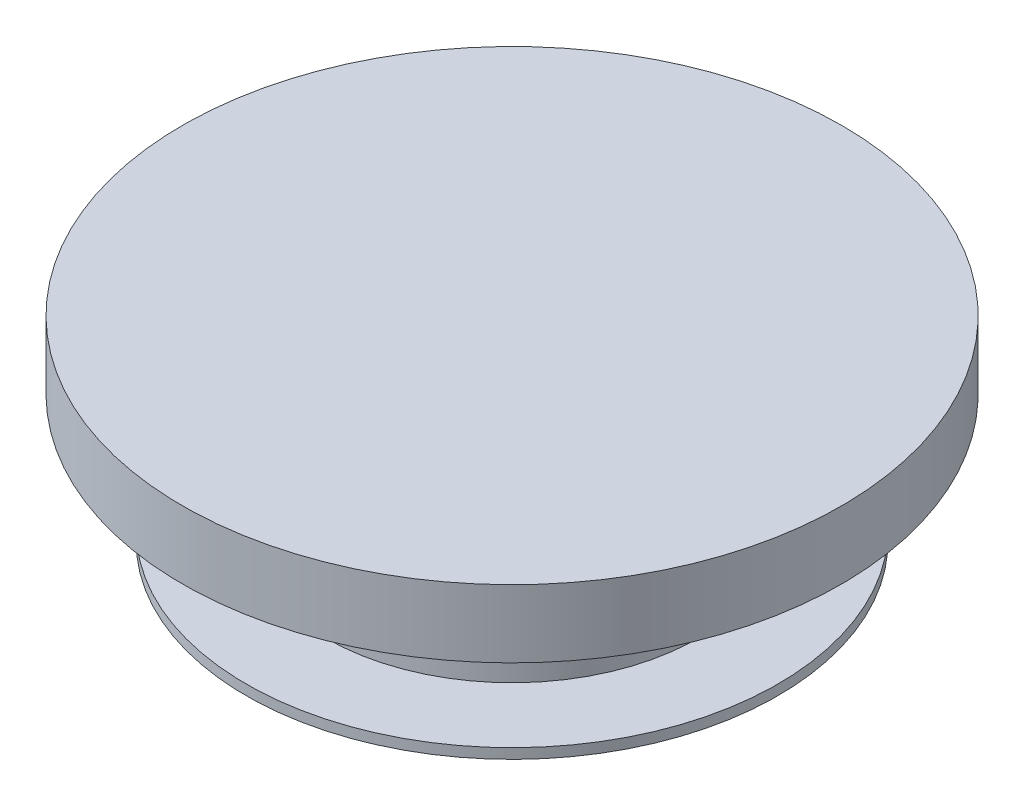
ISO-10303-21;
HEADER;
FILE_DESCRIPTION(('STEP AP214'),'2;1');
FILE_NAME('part.step','',(''),(''),'','','');
FILE_SCHEMA(('AUTOMOTIVE_DESIGN { 1 0 10303 214 1 1 1 1 }'));
ENDSEC;
DATA;
#1=APPLICATION_CONTEXT('core data for automotive mechanical design processes');
#2=APPLICATION_PROTOCOL_DEFINITION('international standard','automotive_design',2000,#1);
#3=PRODUCT_CONTEXT('',#1,'mechanical');
#4=PRODUCT('Part','Part','',(#3));
#5=PRODUCT_RELATED_PRODUCT_CATEGORY('part','',(#4));
#6=PRODUCT_DEFINITION_FORMATION('','',#4);
#7=PRODUCT_DEFINITION_CONTEXT('part definition',#1,'design');
#8=PRODUCT_DEFINITION('design','',#6,#7);
#9=PRODUCT_DEFINITION_SHAPE('','',#8);
#10=(LENGTH_UNIT() NAMED_UNIT(*) SI_UNIT(.MILLI.,.METRE.));
#11=(NAMED_UNIT(*) PLANE_ANGLE_UNIT() SI_UNIT($,.RADIAN.));
#12=(NAMED_UNIT(*) SI_UNIT($,.STERADIAN.) SOLID_ANGLE_UNIT());
#13=UNCERTAINTY_MEASURE_WITH_UNIT(LENGTH_MEASURE(1.E-05),#10,'distance_accuracy_value','');
#14=(GEOMETRIC_REPRESENTATION_CONTEXT(3) GLOBAL_UNCERTAINTY_ASSIGNED_CONTEXT((#13)) GLOBAL_UNIT_ASSIGNED_CONTEXT((#10,
#11,#12)) REPRESENTATION_CONTEXT('',''));
#15=CARTESIAN_POINT('',(0.,0.,0.));
#16=DIRECTION('',(0.,0.,1.));
#17=DIRECTION('',(1.,0.,0.));
#18=AXIS2_PLACEMENT_3D('',#15,#16,#17);
#19=CARTESIAN_POINT('',(0.,31.5,0.));
#20=DIRECTION('',(0.,-1.,0.));
#21=DIRECTION('',(0.,0.,-1.));
#22=AXIS2_PLACEMENT_3D('',#19,#20,#21);
#23=PLANE('',#22);
#24=CARTESIAN_POINT('',(0.,31.5,0.));
#25=DIRECTION('',(0.,-1.,0.));
#26=DIRECTION('',(0.,0.,-1.));
#27=AXIS2_PLACEMENT_3D('',#24,#25,#26);
#28=CIRCLE('',#27,26.);
#29=CARTESIAN_POINT('',(0.,31.5,-26.));
#30=VERTEX_POINT('',#29);
#31=EDGE_CURVE('E10',#30,#30,#28,.T.);
#32=ORIENTED_EDGE('',*,*,#31,.T.);
#33=EDGE_LOOP('',(#32));
#34=FACE_BOUND('',#33,.T.);
#35=ADVANCED_FACE('F372',(#34),#23,.T.);
#36=CARTESIAN_POINT('',(0.,0.,0.));
#37=DIRECTION('',(0.,-1.,0.));
#38=DIRECTION('',(0.,0.,-1.));
#39=AXIS2_PLACEMENT_3D('',#36,#37,#38);
#40=CYLINDRICAL_SURFACE('',#39,26.);
#41=CARTESIAN_POINT('',(0.,17.5,0.));
#42=DIRECTION('',(0.,-1.,0.));
#43=DIRECTION('',(0.,0.,-1.));
#44=AXIS2_PLACEMENT_3D('',#41,#42,#43);
#45=CIRCLE('',#44,26.);
#46=CARTESIAN_POINT('',(0.,17.5,-26.));
#47=VERTEX_POINT('',#46);
#48=EDGE_CURVE('E378',#47,#47,#45,.T.);
#49=ORIENTED_EDGE('',*,*,#48,.T.);
#50=EDGE_LOOP('',(#49));
#51=FACE_BOUND('',#50,.T.);
#52=ORIENTED_EDGE('',*,*,#31,.F.);
#53=EDGE_LOOP('',(#52));
#54=FACE_BOUND('',#53,.T.);
#55=ADVANCED_FACE('F422',(#51,#54),#40,.F.);
#56=CARTESIAN_POINT('',(26.,17.5,0.));
#57=DIRECTION('',(0.,-1.,0.));
#58=DIRECTION('',(0.,0.,-1.));
#59=AXIS2_PLACEMENT_3D('',#56,#57,#58);
#60=PLANE('',#59);
#61=CARTESIAN_POINT('',(0.,17.5,0.));
#62=DIRECTION('',(0.,-1.,0.));
#63=DIRECTION('',(0.,0.,-1.));
#64=AXIS2_PLACEMENT_3D('',#61,#62,#63);
#65=CIRCLE('',#64,39.2380952380952);
#66=CARTESIAN_POINT('',(0.,17.5,-39.2380952380952));
#67=VERTEX_POINT('',#66);
#68=EDGE_CURVE('E382',#67,#67,#65,.T.);
#69=ORIENTED_EDGE('',*,*,#68,.T.);
#70=EDGE_LOOP('',(#69));
#71=FACE_BOUND('',#70,.T.);
#72=ORIENTED_EDGE('',*,*,#48,.F.);
#73=EDGE_LOOP('',(#72));
#74=FACE_BOUND('',#73,.T.);
#75=ADVANCED_FACE('F426',(#71,#74),#60,.T.);
#76=CARTESIAN_POINT('',(0.,0.,0.));
#77=DIRECTION('',(0.,-1.,0.));
#78=DIRECTION('',(0.,0.,-1.));
#79=AXIS2_PLACEMENT_3D('',#76,#77,#78);
#80=CYLINDRICAL_SURFACE('',#79,39.2380952380952);
#81=CARTESIAN_POINT('',(0.,19.,0.));
#82=DIRECTION('',(0.,-1.,0.));
#83=DIRECTION('',(0.,0.,-1.));
#84=AXIS2_PLACEMENT_3D('',#81,#82,#83);
#85=CIRCLE('',#84,39.2380952380952);
#86=CARTESIAN_POINT('',(0.,19.,-39.2380952380952));
#87=VERTEX_POINT('',#86);
#88=EDGE_CURVE('E386',#87,#87,#85,.T.);
#89=ORIENTED_EDGE('',*,*,#88,.T.);
#90=EDGE_LOOP('',(#89));
#91=FACE_BOUND('',#90,.T.);
#92=ORIENTED_EDGE('',*,*,#68,.F.);
#93=EDGE_LOOP('',(#92));
#94=FACE_BOUND('',#93,.T.);
#95=ADVANCED_FACE('F430',(#91,#94),#80,.T.);
#96=CARTESIAN_POINT('',(39.2380952380952,19.,0.));
#97=DIRECTION('',(0.,1.,0.));
#98=DIRECTION('',(0.,0.,1.));
#99=AXIS2_PLACEMENT_3D('',#96,#97,#98);
#100=PLANE('',#99);
#101=CARTESIAN_POINT('',(0.,19.,0.));
#102=DIRECTION('',(0.,-1.,0.));
#103=DIRECTION('',(0.,0.,-1.));
#104=AXIS2_PLACEMENT_3D('',#101,#102,#103);
#105=CIRCLE('',#104,27.5);
#106=CARTESIAN_POINT('',(0.,19.,-27.5));
#107=VERTEX_POINT('',#106);
#108=EDGE_CURVE('E391',#107,#107,#105,.T.);
#109=ORIENTED_EDGE('',*,*,#108,.T.);
#110=EDGE_LOOP('',(#109));
#111=FACE_BOUND('',#110,.T.);
#112=ORIENTED_EDGE('',*,*,#88,.F.);
#113=EDGE_LOOP('',(#112));
#114=FACE_BOUND('',#113,.T.);
#115=ADVANCED_FACE('F437',(#111,#114),#100,.T.);
#116=CARTESIAN_POINT('',(0.,0.,0.));
#117=DIRECTION('',(0.,-1.,0.));
#118=DIRECTION('',(0.,0.,-1.));
#119=AXIS2_PLACEMENT_3D('',#116,#117,#118);
#120=CYLINDRICAL_SURFACE('',#119,27.5);
#121=CARTESIAN_POINT('',(0.,31.,0.));
#122=DIRECTION('',(0.,-1.,0.));
#123=DIRECTION('',(0.,0.,-1.));
#124=AXIS2_PLACEMENT_3D('',#121,#122,#123);
#125=CIRCLE('',#124,27.5);
#126=CARTESIAN_POINT('',(0.,31.,-27.5));
#127=VERTEX_POINT('',#126);
#128=EDGE_CURVE('E394',#127,#127,#125,.T.);
#129=ORIENTED_EDGE('',*,*,#128,.T.);
#130=EDGE_LOOP('',(#129));
#131=FACE_BOUND('',#130,.T.);
#132=ORIENTED_EDGE('',*,*,#108,.F.);
#133=EDGE_LOOP('',(#132));
#134=FACE_BOUND('',#133,.T.);
#135=ADVANCED_FACE('F441',(#131,#134),#120,.T.);
#136=CARTESIAN_POINT('',(27.5,31.,0.));
#137=DIRECTION('',(0.,-1.,0.));
#138=DIRECTION('',(0.,0.,-1.));
#139=AXIS2_PLACEMENT_3D('',#136,#137,#138);
#140=PLANE('',#139);
#141=CARTESIAN_POINT('',(0.,31.,0.));
#142=DIRECTION('',(0.,-1.,0.));
#143=DIRECTION('',(0.,0.,-1.));
#144=AXIS2_PLACEMENT_3D('',#141,#142,#143);
#145=CIRCLE('',#144,39.2380952380952);
#146=CARTESIAN_POINT('',(0.,31.,-39.2380952380952));
#147=VERTEX_POINT('',#146);
#148=EDGE_CURVE('E397',#147,#147,#145,.T.);
#149=ORIENTED_EDGE('',*,*,#148,.T.);
#150=EDGE_LOOP('',(#149));
#151=FACE_BOUND('',#150,.T.);
#152=ORIENTED_EDGE('',*,*,#128,.F.);
#153=EDGE_LOOP('',(#152));
#154=FACE_BOUND('',#153,.T.);
#155=ADVANCED_FACE('F445',(#151,#154),#140,.T.);
#156=CARTESIAN_POINT('',(0.,0.,0.));
#157=DIRECTION('',(0.,-1.,0.));
#158=DIRECTION('',(0.,0.,-1.));
#159=AXIS2_PLACEMENT_3D('',#156,#157,#158);
#160=CYLINDRICAL_SURFACE('',#159,39.2380952380952);
#161=CARTESIAN_POINT('',(0.,36.5,0.));
#162=DIRECTION('',(0.,-1.,0.));
#163=DIRECTION('',(0.,0.,-1.));
#164=AXIS2_PLACEMENT_3D('',#161,#162,#163);
#165=CIRCLE('',#164,39.2380952380952);
#166=CARTESIAN_POINT('',(0.,36.5,-39.2380952380952));
#167=VERTEX_POINT('',#166);
#168=EDGE_CURVE('E400',#167,#167,#165,.T.);
#169=ORIENTED_EDGE('',*,*,#168,.T.);
#170=EDGE_LOOP('',(#169));
#171=FACE_BOUND('',#170,.T.);
#172=ORIENTED_EDGE('',*,*,#148,.F.);
#173=EDGE_LOOP('',(#172));
#174=FACE_BOUND('',#173,.T.);
#175=ADVANCED_FACE('F449',(#171,#174),#160,.T.);
#176=CARTESIAN_POINT('',(39.2380952380952,36.5,0.));
#177=DIRECTION('',(0.,-1.,0.));
#178=DIRECTION('',(0.,0.,-1.));
#179=AXIS2_PLACEMENT_3D('',#176,#177,#178);
#180=PLANE('',#179);
#181=CARTESIAN_POINT('',(0.,36.5,0.));
#182=DIRECTION('',(0.,-1.,0.));
#183=DIRECTION('',(0.,0.,-1.));
#184=AXIS2_PLACEMENT_3D('',#181,#182,#183);
#185=CIRCLE('',#184,48.6576233793687);
#186=CARTESIAN_POINT('',(0.,36.5,-48.6576233793687));
#187=VERTEX_POINT('',#186);
#188=EDGE_CURVE('E403',#187,#187,#185,.T.);
#189=ORIENTED_EDGE('',*,*,#188,.T.);
#190=EDGE_LOOP('',(#189));
#191=FACE_BOUND('',#190,.T.);
#192=ORIENTED_EDGE('',*,*,#168,.F.);
#193=EDGE_LOOP('',(#192));
#194=FACE_BOUND('',#193,.T.);
#195=ADVANCED_FACE('F419',(#191,#194),#180,.T.);
#196=CARTESIAN_POINT('',(0.,0.,0.));
#197=DIRECTION('',(0.,-1.,0.));
#198=DIRECTION('',(0.,0.,-1.));
#199=AXIS2_PLACEMENT_3D('',#196,#197,#198);
#200=CYLINDRICAL_SURFACE('',#199,48.6576233793687);
#201=CARTESIAN_POINT('',(0.,46.5,0.));
#202=DIRECTION('',(0.,-1.,0.));
#203=DIRECTION('',(0.,0.,-1.));
#204=AXIS2_PLACEMENT_3D('',#201,#202,#203);
#205=CIRCLE('',#204,48.6576233793687);
#206=CARTESIAN_POINT('',(0.,46.5,-48.6576233793687));
#207=VERTEX_POINT('',#206);
#208=EDGE_CURVE('E406',#207,#207,#205,.T.);
#209=ORIENTED_EDGE('',*,*,#208,.T.);
#210=EDGE_LOOP('',(#209));
#211=FACE_BOUND('',#210,.T.);
#212=ORIENTED_EDGE('',*,*,#188,.F.);
#213=EDGE_LOOP('',(#212));
#214=FACE_BOUND('',#213,.T.);
#215=ADVANCED_FACE('F410',(#211,#214),#200,.T.);
#216=CARTESIAN_POINT('',(48.6576233793687,46.5,0.));
#217=DIRECTION('',(0.,1.,0.));
#218=DIRECTION('',(0.,0.,1.));
#219=AXIS2_PLACEMENT_3D('',#216,#217,#218);
#220=PLANE('',#219);
#221=ORIENTED_EDGE('',*,*,#208,.F.);
#222=EDGE_LOOP('',(#221));
#223=FACE_BOUND('',#222,.T.);
#224=ADVANCED_FACE('F413',(#223),#220,.T.);
#225=CLOSED_SHELL('',(#35,#55,#75,#95,#115,#135,#155,#175,#195,#215,#224));
#226=MANIFOLD_SOLID_BREP('B2',#225);
#227=ADVANCED_BREP_SHAPE_REPRESENTATION('',(#18,#226),#14);
#228=SHAPE_DEFINITION_REPRESENTATION(#9,#227);
ENDSEC;
END-ISO-10303-21;
